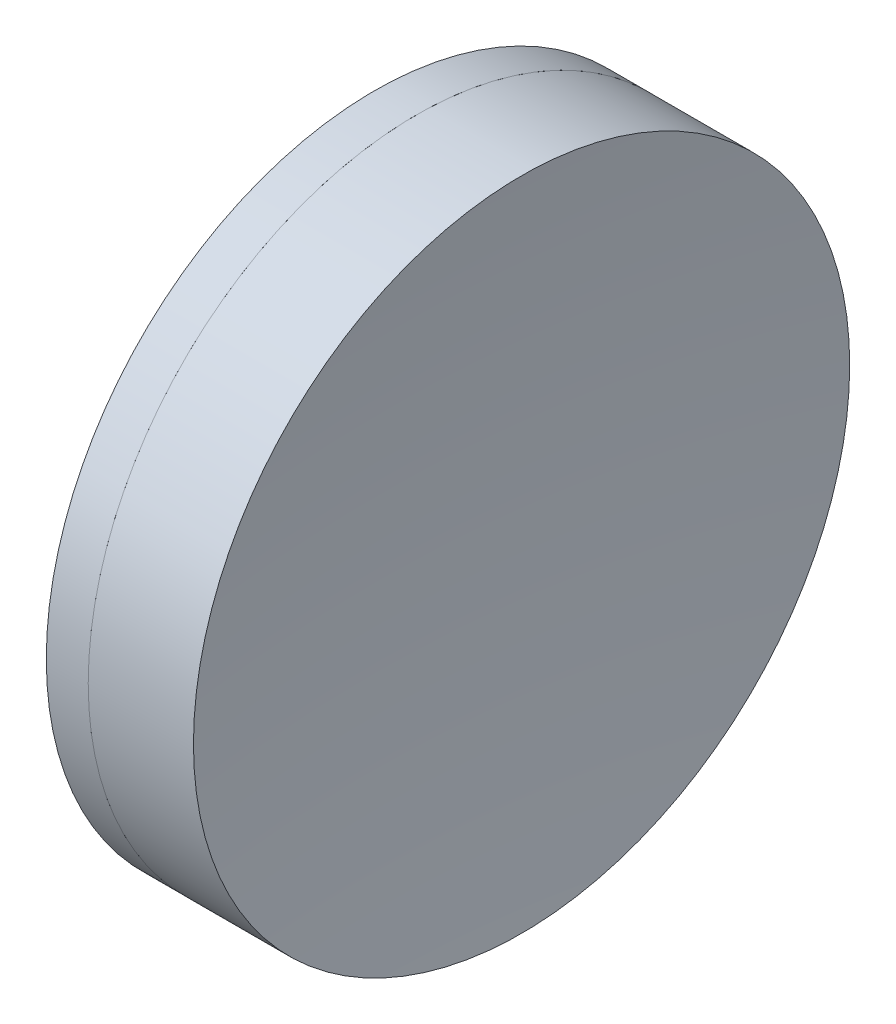
ISO-10303-21;
HEADER;
FILE_DESCRIPTION(('STEP AP214'),'2;1');
FILE_NAME('part.step','',(''),(''),'','','');
FILE_SCHEMA(('AUTOMOTIVE_DESIGN { 1 0 10303 214 1 1 1 1 }'));
ENDSEC;
DATA;
#1=APPLICATION_CONTEXT('core data for automotive mechanical design processes');
#2=APPLICATION_PROTOCOL_DEFINITION('international standard','automotive_design',2000,#1);
#3=PRODUCT_CONTEXT('',#1,'mechanical');
#4=PRODUCT('Part','Part','',(#3));
#5=PRODUCT_RELATED_PRODUCT_CATEGORY('part','',(#4));
#6=PRODUCT_DEFINITION_FORMATION('','',#4);
#7=PRODUCT_DEFINITION_CONTEXT('part definition',#1,'design');
#8=PRODUCT_DEFINITION('design','',#6,#7);
#9=PRODUCT_DEFINITION_SHAPE('','',#8);
#10=(LENGTH_UNIT() NAMED_UNIT(*) SI_UNIT(.MILLI.,.METRE.));
#11=(NAMED_UNIT(*) PLANE_ANGLE_UNIT() SI_UNIT($,.RADIAN.));
#12=(NAMED_UNIT(*) SI_UNIT($,.STERADIAN.) SOLID_ANGLE_UNIT());
#13=UNCERTAINTY_MEASURE_WITH_UNIT(LENGTH_MEASURE(1.E-05),#10,'distance_accuracy_value','');
#14=(GEOMETRIC_REPRESENTATION_CONTEXT(3) GLOBAL_UNCERTAINTY_ASSIGNED_CONTEXT((#13)) GLOBAL_UNIT_ASSIGNED_CONTEXT((#10,
#11,#12)) REPRESENTATION_CONTEXT('',''));
#15=CARTESIAN_POINT('',(0.,0.,0.));
#16=DIRECTION('',(0.,0.,1.));
#17=DIRECTION('',(1.,0.,0.));
#18=AXIS2_PLACEMENT_3D('',#15,#16,#17);
#19=CARTESIAN_POINT('',(61.3594437825909,0.,0.));
#20=DIRECTION('',(-1.,0.,0.));
#21=DIRECTION('',(0.,0.,-1.));
#22=AXIS2_PLACEMENT_3D('',#19,#20,#21);
#23=SPHERICAL_SURFACE('',#22,87.57);
#24=CARTESIAN_POINT('',(145.164842773348,0.,0.));
#25=DIRECTION('',(-1.,0.,0.));
#26=DIRECTION('',(0.,0.,1.));
#27=AXIS2_PLACEMENT_3D('',#24,#25,#26);
#28=CIRCLE('',#27,25.3999999999999);
#29=CARTESIAN_POINT('',(145.164842773348,0.,25.3999999999999));
#30=VERTEX_POINT('',#29);
#31=EDGE_CURVE('E51',#30,#30,#28,.T.);
#32=ORIENTED_EDGE('',*,*,#31,.T.);
#33=EDGE_LOOP('',(#32));
#34=FACE_BOUND('',#33,.T.);
#35=ADVANCED_FACE('F45',(#34),#23,.F.);
#36=CARTESIAN_POINT('',(386.199443782591,0.,0.));
#37=DIRECTION('',(-1.,0.,0.));
#38=DIRECTION('',(0.,0.,-1.));
#39=AXIS2_PLACEMENT_3D('',#36,#37,#38);
#40=SPHERICAL_SURFACE('',#39,234.27);
#41=CARTESIAN_POINT('',(153.310472596749,0.,0.));
#42=DIRECTION('',(-1.,0.,0.));
#43=DIRECTION('',(0.,0.,1.));
#44=AXIS2_PLACEMENT_3D('',#41,#42,#43);
#45=CIRCLE('',#44,25.3999999999999);
#46=CARTESIAN_POINT('',(153.310472596749,0.,25.3999999999999));
#47=VERTEX_POINT('',#46);
#48=EDGE_CURVE('E11',#47,#47,#45,.T.);
#49=ORIENTED_EDGE('',*,*,#48,.F.);
#50=EDGE_LOOP('',(#49));
#51=FACE_BOUND('',#50,.T.);
#52=ADVANCED_FACE('F60',(#51),#40,.F.);
#53=CARTESIAN_POINT('',(-0.551919992657797,0.,0.));
#54=DIRECTION('',(-1.,0.,0.));
#55=DIRECTION('',(0.,0.,1.));
#56=AXIS2_PLACEMENT_3D('',#53,#54,#55);
#57=CYLINDRICAL_SURFACE('',#56,25.3999999999999);
#58=ORIENTED_EDGE('',*,*,#48,.T.);
#59=EDGE_LOOP('',(#58));
#60=FACE_BOUND('',#59,.T.);
#61=ORIENTED_EDGE('',*,*,#31,.F.);
#62=EDGE_LOOP('',(#61));
#63=FACE_BOUND('',#62,.T.);
#64=ADVANCED_FACE('F58',(#60,#63),#57,.T.);
#65=CLOSED_SHELL('',(#35,#52,#64));
#66=MANIFOLD_SOLID_BREP('B2',#65);
#67=CARTESIAN_POINT('',(204.069443782591,0.,0.));
#68=DIRECTION('',(-1.,0.,0.));
#69=DIRECTION('',(0.,0.,1.));
#70=AXIS2_PLACEMENT_3D('',#67,#68,#69);
#71=SPHERICAL_SURFACE('',#70,67.14);
#72=CARTESIAN_POINT('',(141.919467113247,0.,0.));
#73=DIRECTION('',(-1.,0.,0.));
#74=DIRECTION('',(0.,0.,1.));
#75=AXIS2_PLACEMENT_3D('',#72,#73,#74);
#76=CIRCLE('',#75,25.4);
#77=CARTESIAN_POINT('',(141.919467113247,0.,25.4));
#78=VERTEX_POINT('',#77);
#79=EDGE_CURVE('E44',#78,#78,#76,.T.);
#80=ORIENTED_EDGE('',*,*,#79,.T.);
#81=EDGE_LOOP('',(#80));
#82=FACE_BOUND('',#81,.T.);
#83=ADVANCED_FACE('F86',(#82),#71,.T.);
#84=CARTESIAN_POINT('',(-0.816062176165804,0.,0.));
#85=DIRECTION('',(-1.,0.,0.));
#86=DIRECTION('',(0.,0.,1.));
#87=AXIS2_PLACEMENT_3D('',#84,#85,#86);
#88=CYLINDRICAL_SURFACE('',#87,25.4);
#89=CARTESIAN_POINT('',(145.164842773348,0.,0.));
#90=DIRECTION('',(-1.,0.,0.));
#91=DIRECTION('',(0.,0.,1.));
#92=AXIS2_PLACEMENT_3D('',#89,#90,#91);
#93=CIRCLE('',#92,25.4);
#94=CARTESIAN_POINT('',(145.164842773348,0.,25.4));
#95=VERTEX_POINT('',#94);
#96=EDGE_CURVE('E92',#95,#95,#93,.T.);
#97=ORIENTED_EDGE('',*,*,#96,.T.);
#98=EDGE_LOOP('',(#97));
#99=FACE_BOUND('',#98,.T.);
#100=ORIENTED_EDGE('',*,*,#79,.F.);
#101=EDGE_LOOP('',(#100));
#102=FACE_BOUND('',#101,.T.);
#103=ADVANCED_FACE('F98',(#99,#102),#88,.T.);
#104=CARTESIAN_POINT('',(61.3594437825909,0.,0.));
#105=DIRECTION('',(-1.,0.,0.));
#106=DIRECTION('',(0.,0.,1.));
#107=AXIS2_PLACEMENT_3D('',#104,#105,#106);
#108=SPHERICAL_SURFACE('',#107,87.57);
#109=ORIENTED_EDGE('',*,*,#96,.F.);
#110=EDGE_LOOP('',(#109));
#111=FACE_BOUND('',#110,.T.);
#112=ADVANCED_FACE('F101',(#111),#108,.T.);
#113=CLOSED_SHELL('',(#83,#103,#112));
#114=MANIFOLD_SOLID_BREP('B6',#113);
#115=ADVANCED_BREP_SHAPE_REPRESENTATION('',(#18,#66,#114),#14);
#116=SHAPE_DEFINITION_REPRESENTATION(#9,#115);
ENDSEC;
END-ISO-10303-21;
